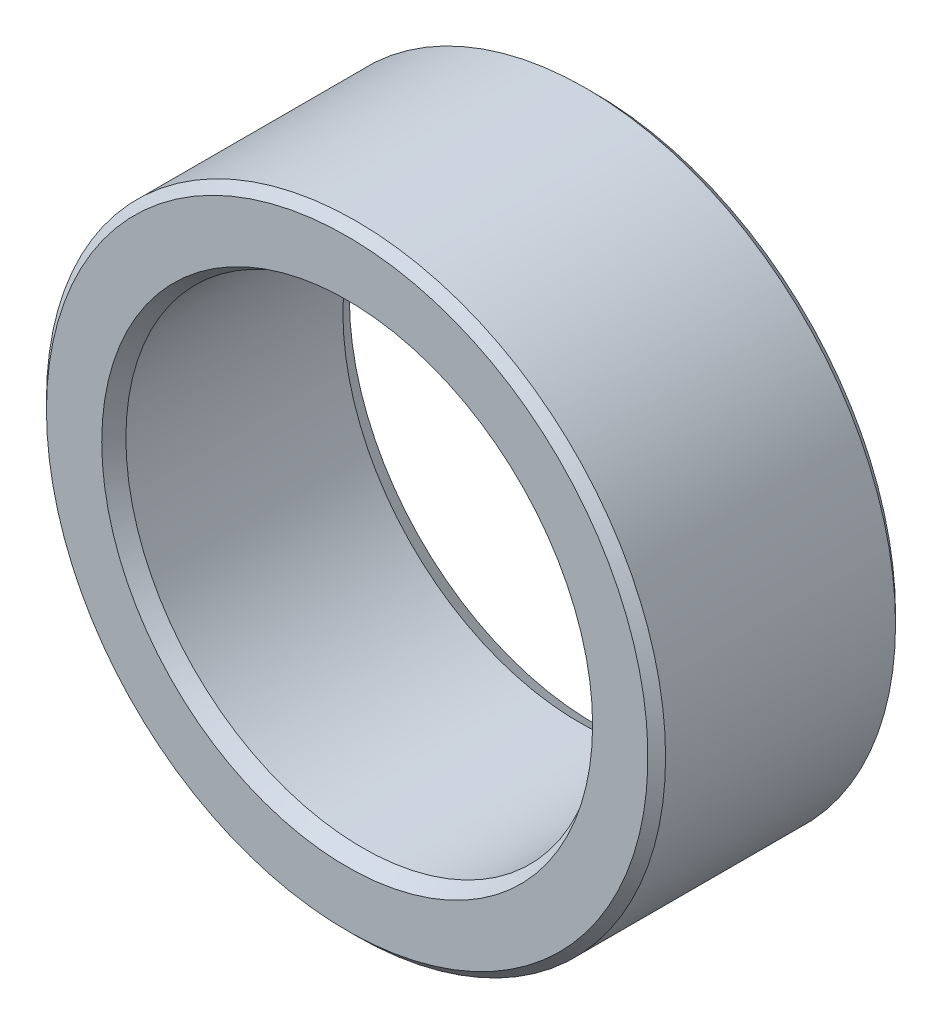
ISO-10303-21;
HEADER;
FILE_DESCRIPTION(('STEP AP214'),'2;1');
FILE_NAME('part.step','',(''),(''),'','','');
FILE_SCHEMA(('AUTOMOTIVE_DESIGN { 1 0 10303 214 1 1 1 1 }'));
ENDSEC;
DATA;
#1=APPLICATION_CONTEXT('core data for automotive mechanical design processes');
#2=APPLICATION_PROTOCOL_DEFINITION('international standard','automotive_design',2000,#1);
#3=PRODUCT_CONTEXT('',#1,'mechanical');
#4=PRODUCT('Part','Part','',(#3));
#5=PRODUCT_RELATED_PRODUCT_CATEGORY('part','',(#4));
#6=PRODUCT_DEFINITION_FORMATION('','',#4);
#7=PRODUCT_DEFINITION_CONTEXT('part definition',#1,'design');
#8=PRODUCT_DEFINITION('design','',#6,#7);
#9=PRODUCT_DEFINITION_SHAPE('','',#8);
#10=(LENGTH_UNIT() NAMED_UNIT(*) SI_UNIT(.MILLI.,.METRE.));
#11=(NAMED_UNIT(*) PLANE_ANGLE_UNIT() SI_UNIT($,.RADIAN.));
#12=(NAMED_UNIT(*) SI_UNIT($,.STERADIAN.) SOLID_ANGLE_UNIT());
#13=UNCERTAINTY_MEASURE_WITH_UNIT(LENGTH_MEASURE(1.E-05),#10,'distance_accuracy_value','');
#14=(GEOMETRIC_REPRESENTATION_CONTEXT(3) GLOBAL_UNCERTAINTY_ASSIGNED_CONTEXT((#13)) GLOBAL_UNIT_ASSIGNED_CONTEXT((#10,
#11,#12)) REPRESENTATION_CONTEXT('',''));
#15=CARTESIAN_POINT('',(0.,0.,0.));
#16=DIRECTION('',(0.,0.,1.));
#17=DIRECTION('',(1.,0.,0.));
#18=AXIS2_PLACEMENT_3D('',#15,#16,#17);
#19=CARTESIAN_POINT('',(0.,6.7945,0.));
#20=DIRECTION('',(0.,0.,-1.));
#21=DIRECTION('',(-1.,0.,0.));
#22=AXIS2_PLACEMENT_3D('',#19,#20,#21);
#23=PLANE('',#22);
#24=CARTESIAN_POINT('',(0.,0.,0.));
#25=DIRECTION('',(0.,0.,-1.));
#26=DIRECTION('',(-1.,0.,0.));
#27=AXIS2_PLACEMENT_3D('',#24,#25,#26);
#28=CIRCLE('',#27,7.04850000000001);
#29=CARTESIAN_POINT('',(-7.04850000000001,0.,0.));
#30=VERTEX_POINT('',#29);
#31=EDGE_CURVE('E29',#30,#30,#28,.T.);
#32=ORIENTED_EDGE('',*,*,#31,.T.);
#33=EDGE_LOOP('',(#32));
#34=FACE_BOUND('',#33,.T.);
#35=CARTESIAN_POINT('',(0.,0.,0.));
#36=DIRECTION('',(0.,0.,-1.));
#37=DIRECTION('',(-1.,0.,0.));
#38=AXIS2_PLACEMENT_3D('',#35,#36,#37);
#39=CIRCLE('',#38,8.636);
#40=CARTESIAN_POINT('',(-8.636,0.,0.));
#41=VERTEX_POINT('',#40);
#42=EDGE_CURVE('E37',#41,#41,#39,.F.);
#43=ORIENTED_EDGE('',*,*,#42,.T.);
#44=EDGE_LOOP('',(#43));
#45=FACE_BOUND('',#44,.T.);
#46=ADVANCED_FACE('F14',(#34,#45),#23,.F.);
#47=CARTESIAN_POINT('',(0.,0.,-8.65469128557364));
#48=DIRECTION('',(0.,0.,-1.));
#49=DIRECTION('',(-1.,0.,0.));
#50=AXIS2_PLACEMENT_3D('',#47,#48,#49);
#51=CYLINDRICAL_SURFACE('',#50,8.89);
#52=CARTESIAN_POINT('',(0.,0.,-0.253999999999996));
#53=DIRECTION('',(0.,0.,-1.));
#54=DIRECTION('',(-1.,0.,0.));
#55=AXIS2_PLACEMENT_3D('',#52,#53,#54);
#56=CIRCLE('',#55,8.89);
#57=CARTESIAN_POINT('',(-8.89,0.,-0.253999999999994));
#58=VERTEX_POINT('',#57);
#59=EDGE_CURVE('E40',#58,#58,#56,.T.);
#60=ORIENTED_EDGE('',*,*,#59,.T.);
#61=EDGE_LOOP('',(#60));
#62=FACE_BOUND('',#61,.T.);
#63=CARTESIAN_POINT('',(0.,0.,-6.85799999999999));
#64=DIRECTION('',(0.,0.,1.));
#65=DIRECTION('',(1.,0.,0.));
#66=AXIS2_PLACEMENT_3D('',#63,#64,#65);
#67=CIRCLE('',#66,8.89);
#68=CARTESIAN_POINT('',(8.89,0.,-6.85799999999999));
#69=VERTEX_POINT('',#68);
#70=EDGE_CURVE('E43',#69,#69,#67,.T.);
#71=ORIENTED_EDGE('',*,*,#70,.T.);
#72=EDGE_LOOP('',(#71));
#73=FACE_BOUND('',#72,.T.);
#74=ADVANCED_FACE('F47',(#62,#73),#51,.T.);
#75=CARTESIAN_POINT('',(0.,8.89,-7.112));
#76=DIRECTION('',(0.,0.,1.));
#77=DIRECTION('',(1.,0.,0.));
#78=AXIS2_PLACEMENT_3D('',#75,#76,#77);
#79=PLANE('',#78);
#80=CARTESIAN_POINT('',(0.,0.,-7.112));
#81=DIRECTION('',(0.,0.,1.));
#82=DIRECTION('',(1.,0.,0.));
#83=AXIS2_PLACEMENT_3D('',#80,#81,#82);
#84=CIRCLE('',#83,7.04850000000001);
#85=CARTESIAN_POINT('',(7.04850000000001,0.,-7.112));
#86=VERTEX_POINT('',#85);
#87=EDGE_CURVE('E10',#86,#86,#84,.T.);
#88=ORIENTED_EDGE('',*,*,#87,.T.);
#89=EDGE_LOOP('',(#88));
#90=FACE_BOUND('',#89,.T.);
#91=CARTESIAN_POINT('',(0.,0.,-7.112));
#92=DIRECTION('',(0.,0.,1.));
#93=DIRECTION('',(1.,0.,0.));
#94=AXIS2_PLACEMENT_3D('',#91,#92,#93);
#95=CIRCLE('',#94,8.63599999999999);
#96=CARTESIAN_POINT('',(8.63599999999999,0.,-7.112));
#97=VERTEX_POINT('',#96);
#98=EDGE_CURVE('E34',#97,#97,#95,.F.);
#99=ORIENTED_EDGE('',*,*,#98,.T.);
#100=EDGE_LOOP('',(#99));
#101=FACE_BOUND('',#100,.T.);
#102=ADVANCED_FACE('F57',(#90,#101),#79,.F.);
#103=CARTESIAN_POINT('',(0.,0.,-8.65469128557364));
#104=DIRECTION('',(0.,0.,-1.));
#105=DIRECTION('',(-1.,0.,0.));
#106=AXIS2_PLACEMENT_3D('',#103,#104,#105);
#107=CYLINDRICAL_SURFACE('',#106,6.7945);
#108=CARTESIAN_POINT('',(0.,0.,-0.439940905122503));
#109=DIRECTION('',(0.,0.,-1.));
#110=DIRECTION('',(-1.,0.,0.));
#111=AXIS2_PLACEMENT_3D('',#108,#109,#110);
#112=CIRCLE('',#111,6.7945);
#113=CARTESIAN_POINT('',(-6.7945,0.,-0.439940905122502));
#114=VERTEX_POINT('',#113);
#115=EDGE_CURVE('E21',#114,#114,#112,.F.);
#116=ORIENTED_EDGE('',*,*,#115,.T.);
#117=EDGE_LOOP('',(#116));
#118=FACE_BOUND('',#117,.T.);
#119=CARTESIAN_POINT('',(0.,0.,-6.67205909487749));
#120=DIRECTION('',(0.,0.,1.));
#121=DIRECTION('',(1.,0.,0.));
#122=AXIS2_PLACEMENT_3D('',#119,#120,#121);
#123=CIRCLE('',#122,6.7945);
#124=CARTESIAN_POINT('',(6.7945,0.,-6.67205909487749));
#125=VERTEX_POINT('',#124);
#126=EDGE_CURVE('E25',#125,#125,#123,.F.);
#127=ORIENTED_EDGE('',*,*,#126,.T.);
#128=EDGE_LOOP('',(#127));
#129=FACE_BOUND('',#128,.T.);
#130=ADVANCED_FACE('F59',(#118,#129),#107,.F.);
#131=CARTESIAN_POINT('',(0.,0.,-0.253999999999996));
#132=DIRECTION('',(0.,0.,-1.));
#133=DIRECTION('',(-1.,0.,0.));
#134=AXIS2_PLACEMENT_3D('',#131,#132,#133);
#135=CONICAL_SURFACE('',#134,8.89,0.785398163397455);
#136=ORIENTED_EDGE('',*,*,#42,.F.);
#137=EDGE_LOOP('',(#136));
#138=FACE_BOUND('',#137,.T.);
#139=ORIENTED_EDGE('',*,*,#59,.F.);
#140=EDGE_LOOP('',(#139));
#141=FACE_BOUND('',#140,.T.);
#142=ADVANCED_FACE('F53',(#138,#141),#135,.T.);
#143=CARTESIAN_POINT('',(0.,0.,-7.112));
#144=DIRECTION('',(0.,0.,1.));
#145=DIRECTION('',(1.,0.,0.));
#146=AXIS2_PLACEMENT_3D('',#143,#144,#145);
#147=CONICAL_SURFACE('',#146,8.63599999999999,0.785398163397445);
#148=ORIENTED_EDGE('',*,*,#70,.F.);
#149=EDGE_LOOP('',(#148));
#150=FACE_BOUND('',#149,.T.);
#151=ORIENTED_EDGE('',*,*,#98,.F.);
#152=EDGE_LOOP('',(#151));
#153=FACE_BOUND('',#152,.T.);
#154=ADVANCED_FACE('F49',(#150,#153),#147,.T.);
#155=CARTESIAN_POINT('',(0.,0.,0.));
#156=DIRECTION('',(0.,0.,1.));
#157=DIRECTION('',(1.,0.,0.));
#158=AXIS2_PLACEMENT_3D('',#155,#156,#157);
#159=CONICAL_SURFACE('',#158,7.04850000000001,0.523598775598304);
#160=ORIENTED_EDGE('',*,*,#115,.F.);
#161=EDGE_LOOP('',(#160));
#162=FACE_BOUND('',#161,.T.);
#163=ORIENTED_EDGE('',*,*,#31,.F.);
#164=EDGE_LOOP('',(#163));
#165=FACE_BOUND('',#164,.T.);
#166=ADVANCED_FACE('F52',(#162,#165),#159,.F.);
#167=CARTESIAN_POINT('',(0.,0.,-6.67205909487749));
#168=DIRECTION('',(0.,0.,-1.));
#169=DIRECTION('',(-1.,0.,0.));
#170=AXIS2_PLACEMENT_3D('',#167,#168,#169);
#171=CONICAL_SURFACE('',#170,6.7945,0.523598775598297);
#172=ORIENTED_EDGE('',*,*,#87,.F.);
#173=EDGE_LOOP('',(#172));
#174=FACE_BOUND('',#173,.T.);
#175=ORIENTED_EDGE('',*,*,#126,.F.);
#176=EDGE_LOOP('',(#175));
#177=FACE_BOUND('',#176,.T.);
#178=ADVANCED_FACE('F16',(#174,#177),#171,.F.);
#179=CLOSED_SHELL('',(#46,#74,#102,#130,#142,#154,#166,#178));
#180=MANIFOLD_SOLID_BREP('B1',#179);
#181=ADVANCED_BREP_SHAPE_REPRESENTATION('',(#18,#180),#14);
#182=SHAPE_DEFINITION_REPRESENTATION(#9,#181);
ENDSEC;
END-ISO-10303-21;
